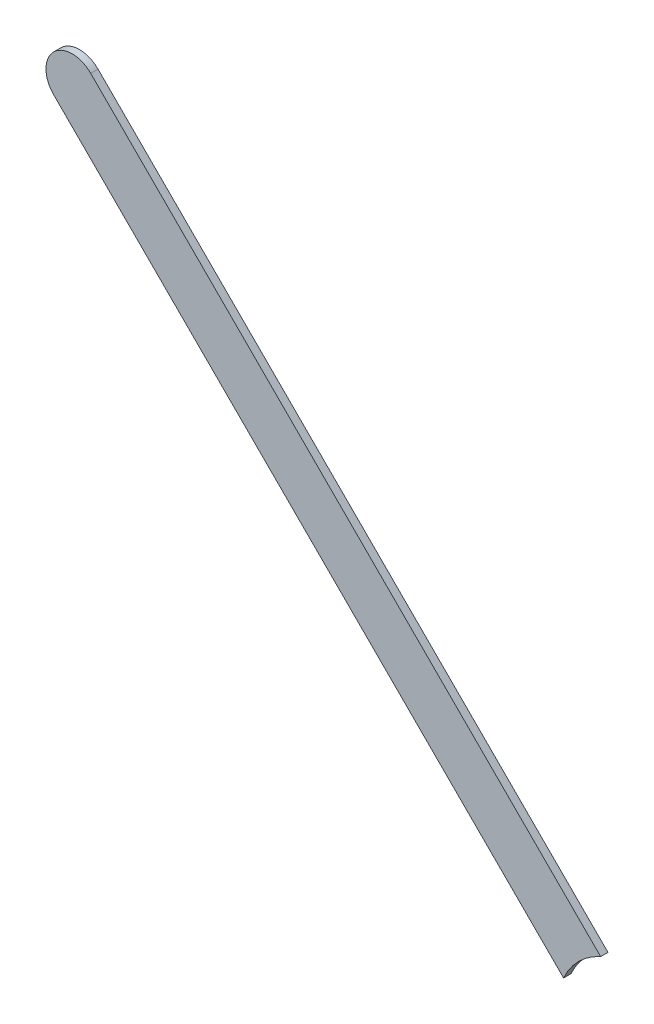
ISO-10303-21;
HEADER;
FILE_DESCRIPTION(('STEP AP214'),'2;1');
FILE_NAME('part.step','',(''),(''),'','','');
FILE_SCHEMA(('AUTOMOTIVE_DESIGN { 1 0 10303 214 1 1 1 1 }'));
ENDSEC;
DATA;
#1=APPLICATION_CONTEXT('core data for automotive mechanical design processes');
#2=APPLICATION_PROTOCOL_DEFINITION('international standard','automotive_design',2000,#1);
#3=PRODUCT_CONTEXT('',#1,'mechanical');
#4=PRODUCT('Part','Part','',(#3));
#5=PRODUCT_RELATED_PRODUCT_CATEGORY('part','',(#4));
#6=PRODUCT_DEFINITION_FORMATION('','',#4);
#7=PRODUCT_DEFINITION_CONTEXT('part definition',#1,'design');
#8=PRODUCT_DEFINITION('design','',#6,#7);
#9=PRODUCT_DEFINITION_SHAPE('','',#8);
#10=(LENGTH_UNIT() NAMED_UNIT(*) SI_UNIT(.MILLI.,.METRE.));
#11=(NAMED_UNIT(*) PLANE_ANGLE_UNIT() SI_UNIT($,.RADIAN.));
#12=(NAMED_UNIT(*) SI_UNIT($,.STERADIAN.) SOLID_ANGLE_UNIT());
#13=UNCERTAINTY_MEASURE_WITH_UNIT(LENGTH_MEASURE(1.E-05),#10,'distance_accuracy_value','');
#14=(GEOMETRIC_REPRESENTATION_CONTEXT(3) GLOBAL_UNCERTAINTY_ASSIGNED_CONTEXT((#13)) GLOBAL_UNIT_ASSIGNED_CONTEXT((#10,
#11,#12)) REPRESENTATION_CONTEXT('',''));
#15=CARTESIAN_POINT('',(0.,0.,0.));
#16=DIRECTION('',(0.,0.,1.));
#17=DIRECTION('',(1.,0.,0.));
#18=AXIS2_PLACEMENT_3D('',#15,#16,#17);
#19=CARTESIAN_POINT('',(76.72016914,77.20417376,0.));
#20=DIRECTION('',(0.707106781186546,0.70710678118655,0.));
#21=DIRECTION('',(0.70710678118655,-0.707106781186546,0.));
#22=AXIS2_PLACEMENT_3D('',#19,#20,#21);
#23=PLANE('',#22);
#24=DIRECTION('',(0.70710678118655,-0.707106781186546,0.));
#25=VECTOR('',#24,1.);
#26=CARTESIAN_POINT('',(76.72016914,77.20417376,0.03556));
#27=LINE('',#26,#25);
#28=CARTESIAN_POINT('',(76.72016914,77.20417376,0.03556));
#29=VERTEX_POINT('',#28);
#30=CARTESIAN_POINT('',(79.1923070971966,74.7320358028035,0.03556));
#31=VERTEX_POINT('',#30);
#32=EDGE_CURVE('E11',#29,#31,#27,.T.);
#33=ORIENTED_EDGE('',*,*,#32,.F.);
#34=DIRECTION('',(0.,0.,1.));
#35=VECTOR('',#34,1.);
#36=CARTESIAN_POINT('',(76.72016914,77.20417376,0.));
#37=LINE('',#36,#35);
#38=CARTESIAN_POINT('',(76.72016914,77.20417376,0.));
#39=VERTEX_POINT('',#38);
#40=EDGE_CURVE('E24',#39,#29,#37,.T.);
#41=ORIENTED_EDGE('',*,*,#40,.F.);
#42=DIRECTION('',(0.70710678118655,-0.707106781186546,0.));
#43=VECTOR('',#42,1.);
#44=CARTESIAN_POINT('',(76.72016914,77.20417376,0.));
#45=LINE('',#44,#43);
#46=CARTESIAN_POINT('',(79.1923070971966,74.7320358028035,0.));
#47=VERTEX_POINT('',#46);
#48=EDGE_CURVE('E75',#39,#47,#45,.T.);
#49=ORIENTED_EDGE('',*,*,#48,.T.);
#50=DIRECTION('',(0.,0.,1.));
#51=VECTOR('',#50,1.);
#52=CARTESIAN_POINT('',(79.1923070971966,74.7320358028035,0.));
#53=LINE('',#52,#51);
#54=EDGE_CURVE('E37',#47,#31,#53,.T.);
#55=ORIENTED_EDGE('',*,*,#54,.T.);
#56=EDGE_LOOP('',(#33,#41,#49,#55));
#57=FACE_BOUND('',#56,.T.);
#58=ADVANCED_FACE('F17',(#57),#23,.F.);
#59=CARTESIAN_POINT('',(79.5169733,74.586973,0.));
#60=DIRECTION('',(0.,0.,-1.));
#61=DIRECTION('',(1.,0.,0.));
#62=AXIS2_PLACEMENT_3D('',#59,#60,#61);
#63=CYLINDRICAL_SURFACE('',#62,0.3556);
#64=DIRECTION('',(0.,0.,1.));
#65=VECTOR('',#64,1.);
#66=CARTESIAN_POINT('',(79.3719122527918,74.9116399872082,0.));
#67=LINE('',#66,#65);
#68=CARTESIAN_POINT('',(79.3719122527918,74.9116399872082,0.));
#69=VERTEX_POINT('',#68);
#70=CARTESIAN_POINT('',(79.3719122527918,74.9116399872082,0.03556));
#71=VERTEX_POINT('',#70);
#72=EDGE_CURVE('E67',#69,#71,#67,.T.);
#73=ORIENTED_EDGE('',*,*,#72,.T.);
#74=CARTESIAN_POINT('',(79.5169733,74.586973,0.03556));
#75=DIRECTION('',(0.,0.,1.));
#76=DIRECTION('',(1.,0.,0.));
#77=AXIS2_PLACEMENT_3D('',#74,#75,#76);
#78=CIRCLE('',#77,0.3556);
#79=EDGE_CURVE('E82',#71,#31,#78,.T.);
#80=ORIENTED_EDGE('',*,*,#79,.T.);
#81=ORIENTED_EDGE('',*,*,#54,.F.);
#82=CARTESIAN_POINT('',(79.5169733,74.586973,0.));
#83=DIRECTION('',(0.,0.,1.));
#84=DIRECTION('',(1.,0.,0.));
#85=AXIS2_PLACEMENT_3D('',#82,#83,#84);
#86=CIRCLE('',#85,0.3556);
#87=EDGE_CURVE('E80',#69,#47,#86,.T.);
#88=ORIENTED_EDGE('',*,*,#87,.F.);
#89=EDGE_LOOP('',(#73,#80,#81,#88));
#90=FACE_BOUND('',#89,.T.);
#91=ADVANCED_FACE('F88',(#90),#63,.F.);
#92=CARTESIAN_POINT('',(79.3719122527918,74.9116399872082,0.));
#93=DIRECTION('',(-0.707106781186546,-0.70710678118655,0.));
#94=DIRECTION('',(-0.70710678118655,0.707106781186546,0.));
#95=AXIS2_PLACEMENT_3D('',#92,#93,#94);
#96=PLANE('',#95);
#97=DIRECTION('',(-0.70710678118655,0.707106781186546,0.));
#98=VECTOR('',#97,1.);
#99=CARTESIAN_POINT('',(79.606775,74.67677724,0.03556));
#100=LINE('',#99,#98);
#101=CARTESIAN_POINT('',(76.89977508,77.38377716,0.03556));
#102=VERTEX_POINT('',#101);
#103=EDGE_CURVE('E71',#71,#102,#100,.T.);
#104=ORIENTED_EDGE('',*,*,#103,.F.);
#105=ORIENTED_EDGE('',*,*,#72,.F.);
#106=DIRECTION('',(-0.70710678118655,0.707106781186546,0.));
#107=VECTOR('',#106,1.);
#108=CARTESIAN_POINT('',(79.606775,74.67677724,0.));
#109=LINE('',#108,#107);
#110=CARTESIAN_POINT('',(76.89977508,77.38377716,0.));
#111=VERTEX_POINT('',#110);
#112=EDGE_CURVE('E63',#69,#111,#109,.T.);
#113=ORIENTED_EDGE('',*,*,#112,.T.);
#114=DIRECTION('',(0.,0.,1.));
#115=VECTOR('',#114,1.);
#116=CARTESIAN_POINT('',(76.89977508,77.38377716,0.));
#117=LINE('',#116,#115);
#118=EDGE_CURVE('E53',#111,#102,#117,.T.);
#119=ORIENTED_EDGE('',*,*,#118,.T.);
#120=EDGE_LOOP('',(#104,#105,#113,#119));
#121=FACE_BOUND('',#120,.T.);
#122=ADVANCED_FACE('F66',(#121),#96,.F.);
#123=CARTESIAN_POINT('',(76.80997211,77.29397546,0.));
#124=DIRECTION('',(0.,0.,-1.));
#125=DIRECTION('',(0.707111781181515,0.707101781156225,0.));
#126=AXIS2_PLACEMENT_3D('',#123,#124,#125);
#127=CYLINDRICAL_SURFACE('',#126,0.126999680092943);
#128=CARTESIAN_POINT('',(76.80997211,77.29397546,0.03556));
#129=DIRECTION('',(0.,0.,1.));
#130=DIRECTION('',(0.707111781181515,0.707101781156225,0.));
#131=AXIS2_PLACEMENT_3D('',#128,#129,#130);
#132=CIRCLE('',#131,0.126999680092943);
#133=EDGE_CURVE('E59',#102,#29,#132,.T.);
#134=ORIENTED_EDGE('',*,*,#133,.F.);
#135=ORIENTED_EDGE('',*,*,#118,.F.);
#136=CARTESIAN_POINT('',(76.80997211,77.29397546,0.));
#137=DIRECTION('',(0.,0.,1.));
#138=DIRECTION('',(0.707111781181515,0.707101781156225,0.));
#139=AXIS2_PLACEMENT_3D('',#136,#137,#138);
#140=CIRCLE('',#139,0.126999680092943);
#141=EDGE_CURVE('E57',#111,#39,#140,.T.);
#142=ORIENTED_EDGE('',*,*,#141,.T.);
#143=ORIENTED_EDGE('',*,*,#40,.T.);
#144=EDGE_LOOP('',(#134,#135,#142,#143));
#145=FACE_BOUND('',#144,.T.);
#146=ADVANCED_FACE('F55',(#145),#127,.T.);
#147=CARTESIAN_POINT('',(76.72016914,77.20417376,0.));
#148=DIRECTION('',(0.,0.,-1.));
#149=DIRECTION('',(-1.,0.,0.));
#150=AXIS2_PLACEMENT_3D('',#147,#148,#149);
#151=PLANE('',#150);
#152=ORIENTED_EDGE('',*,*,#48,.F.);
#153=ORIENTED_EDGE('',*,*,#141,.F.);
#154=ORIENTED_EDGE('',*,*,#112,.F.);
#155=ORIENTED_EDGE('',*,*,#87,.T.);
#156=EDGE_LOOP('',(#152,#153,#154,#155));
#157=FACE_BOUND('',#156,.T.);
#158=ADVANCED_FACE('F74',(#157),#151,.T.);
#159=CARTESIAN_POINT('',(76.72016914,77.20417376,0.03556));
#160=DIRECTION('',(0.,0.,-1.));
#161=DIRECTION('',(-1.,0.,0.));
#162=AXIS2_PLACEMENT_3D('',#159,#160,#161);
#163=PLANE('',#162);
#164=ORIENTED_EDGE('',*,*,#133,.T.);
#165=ORIENTED_EDGE('',*,*,#32,.T.);
#166=ORIENTED_EDGE('',*,*,#79,.F.);
#167=ORIENTED_EDGE('',*,*,#103,.T.);
#168=EDGE_LOOP('',(#164,#165,#166,#167));
#169=FACE_BOUND('',#168,.T.);
#170=ADVANCED_FACE('F91',(#169),#163,.F.);
#171=CLOSED_SHELL('',(#58,#91,#122,#146,#158,#170));
#172=MANIFOLD_SOLID_BREP('B1',#171);
#173=ADVANCED_BREP_SHAPE_REPRESENTATION('',(#18,#172),#14);
#174=SHAPE_DEFINITION_REPRESENTATION(#9,#173);
ENDSEC;
END-ISO-10303-21;
